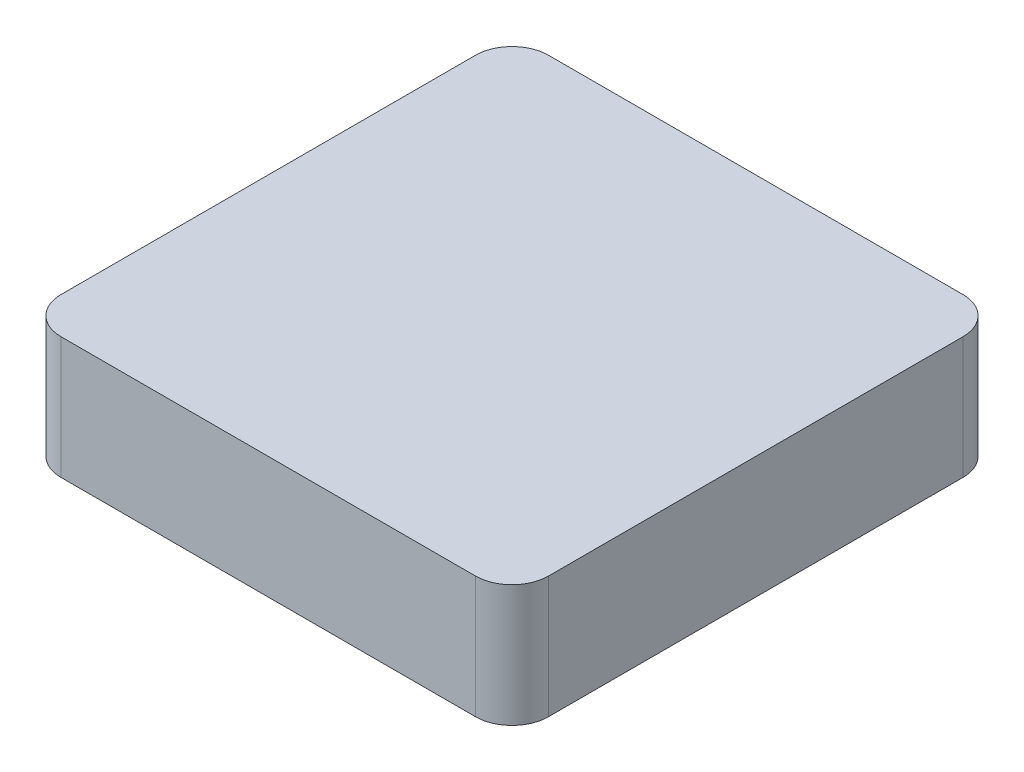
ISO-10303-21;
HEADER;
FILE_DESCRIPTION(('STEP AP214'),'2;1');
FILE_NAME('part.step','',(''),(''),'','','');
FILE_SCHEMA(('AUTOMOTIVE_DESIGN { 1 0 10303 214 1 1 1 1 }'));
ENDSEC;
DATA;
#1=APPLICATION_CONTEXT('core data for automotive mechanical design processes');
#2=APPLICATION_PROTOCOL_DEFINITION('international standard','automotive_design',2000,#1);
#3=PRODUCT_CONTEXT('',#1,'mechanical');
#4=PRODUCT('Part','Part','',(#3));
#5=PRODUCT_RELATED_PRODUCT_CATEGORY('part','',(#4));
#6=PRODUCT_DEFINITION_FORMATION('','',#4);
#7=PRODUCT_DEFINITION_CONTEXT('part definition',#1,'design');
#8=PRODUCT_DEFINITION('design','',#6,#7);
#9=PRODUCT_DEFINITION_SHAPE('','',#8);
#10=(LENGTH_UNIT() NAMED_UNIT(*) SI_UNIT(.MILLI.,.METRE.));
#11=(NAMED_UNIT(*) PLANE_ANGLE_UNIT() SI_UNIT($,.RADIAN.));
#12=(NAMED_UNIT(*) SI_UNIT($,.STERADIAN.) SOLID_ANGLE_UNIT());
#13=UNCERTAINTY_MEASURE_WITH_UNIT(LENGTH_MEASURE(1.E-05),#10,'distance_accuracy_value','');
#14=(GEOMETRIC_REPRESENTATION_CONTEXT(3) GLOBAL_UNCERTAINTY_ASSIGNED_CONTEXT((#13)) GLOBAL_UNIT_ASSIGNED_CONTEXT((#10,
#11,#12)) REPRESENTATION_CONTEXT('',''));
#15=CARTESIAN_POINT('',(0.,0.,0.));
#16=DIRECTION('',(0.,0.,1.));
#17=DIRECTION('',(1.,0.,0.));
#18=AXIS2_PLACEMENT_3D('',#15,#16,#17);
#19=CARTESIAN_POINT('',(-8.5,5.,-8.5));
#20=DIRECTION('',(0.,-1.,0.));
#21=DIRECTION('',(0.,0.,-1.));
#22=AXIS2_PLACEMENT_3D('',#19,#20,#21);
#23=CYLINDRICAL_SURFACE('',#22,1.5);
#24=CARTESIAN_POINT('',(-8.5,0.,-8.5));
#25=DIRECTION('',(0.,1.,0.));
#26=DIRECTION('',(0.,0.,-1.));
#27=AXIS2_PLACEMENT_3D('',#24,#25,#26);
#28=CIRCLE('',#27,1.5);
#29=CARTESIAN_POINT('',(-8.49999999999999,0.,-10.));
#30=VERTEX_POINT('',#29);
#31=CARTESIAN_POINT('',(-10.,0.,-8.49999999999999));
#32=VERTEX_POINT('',#31);
#33=EDGE_CURVE('E140',#30,#32,#28,.T.);
#34=ORIENTED_EDGE('',*,*,#33,.T.);
#35=DIRECTION('',(0.,-1.,0.));
#36=VECTOR('',#35,1.);
#37=CARTESIAN_POINT('',(-10.,5.,-8.49999999999999));
#38=LINE('',#37,#36);
#39=CARTESIAN_POINT('',(-10.,5.,-8.49999999999999));
#40=VERTEX_POINT('',#39);
#41=EDGE_CURVE('E11',#40,#32,#38,.T.);
#42=ORIENTED_EDGE('',*,*,#41,.F.);
#43=CARTESIAN_POINT('',(-8.5,5.,-8.5));
#44=DIRECTION('',(0.,1.,0.));
#45=DIRECTION('',(0.,0.,-1.));
#46=AXIS2_PLACEMENT_3D('',#43,#44,#45);
#47=CIRCLE('',#46,1.5);
#48=CARTESIAN_POINT('',(-8.49999999999999,5.,-10.));
#49=VERTEX_POINT('',#48);
#50=EDGE_CURVE('E162',#49,#40,#47,.T.);
#51=ORIENTED_EDGE('',*,*,#50,.F.);
#52=DIRECTION('',(0.,-1.,0.));
#53=VECTOR('',#52,1.);
#54=CARTESIAN_POINT('',(-8.49999999999999,5.,-10.));
#55=LINE('',#54,#53);
#56=EDGE_CURVE('E136',#49,#30,#55,.T.);
#57=ORIENTED_EDGE('',*,*,#56,.T.);
#58=EDGE_LOOP('',(#34,#42,#51,#57));
#59=FACE_BOUND('',#58,.T.);
#60=ADVANCED_FACE('F39',(#59),#23,.T.);
#61=CARTESIAN_POINT('',(-10.,5.,8.49999999999999));
#62=DIRECTION('',(1.,0.,0.));
#63=DIRECTION('',(0.,0.,-1.));
#64=AXIS2_PLACEMENT_3D('',#61,#62,#63);
#65=PLANE('',#64);
#66=DIRECTION('',(0.,0.,1.));
#67=VECTOR('',#66,1.);
#68=CARTESIAN_POINT('',(-10.,0.,8.49999999999999));
#69=LINE('',#68,#67);
#70=CARTESIAN_POINT('',(-10.,0.,8.49999999999999));
#71=VERTEX_POINT('',#70);
#72=EDGE_CURVE('E144',#32,#71,#69,.T.);
#73=ORIENTED_EDGE('',*,*,#72,.T.);
#74=DIRECTION('',(0.,-1.,0.));
#75=VECTOR('',#74,1.);
#76=CARTESIAN_POINT('',(-10.,5.,8.49999999999999));
#77=LINE('',#76,#75);
#78=CARTESIAN_POINT('',(-10.,5.,8.49999999999999));
#79=VERTEX_POINT('',#78);
#80=EDGE_CURVE('E48',#79,#71,#77,.T.);
#81=ORIENTED_EDGE('',*,*,#80,.F.);
#82=DIRECTION('',(0.,0.,1.));
#83=VECTOR('',#82,1.);
#84=CARTESIAN_POINT('',(-10.,5.,8.49999999999999));
#85=LINE('',#84,#83);
#86=EDGE_CURVE('E99',#40,#79,#85,.T.);
#87=ORIENTED_EDGE('',*,*,#86,.F.);
#88=ORIENTED_EDGE('',*,*,#41,.T.);
#89=EDGE_LOOP('',(#73,#81,#87,#88));
#90=FACE_BOUND('',#89,.T.);
#91=ADVANCED_FACE('F208',(#90),#65,.F.);
#92=CARTESIAN_POINT('',(-8.5,5.,8.5));
#93=DIRECTION('',(0.,-1.,0.));
#94=DIRECTION('',(0.,0.,-1.));
#95=AXIS2_PLACEMENT_3D('',#92,#93,#94);
#96=CYLINDRICAL_SURFACE('',#95,1.5);
#97=CARTESIAN_POINT('',(-8.5,0.,8.5));
#98=DIRECTION('',(0.,1.,0.));
#99=DIRECTION('',(0.,0.,-1.));
#100=AXIS2_PLACEMENT_3D('',#97,#98,#99);
#101=CIRCLE('',#100,1.5);
#102=CARTESIAN_POINT('',(-8.49999999999999,0.,10.));
#103=VERTEX_POINT('',#102);
#104=EDGE_CURVE('E147',#71,#103,#101,.T.);
#105=ORIENTED_EDGE('',*,*,#104,.T.);
#106=DIRECTION('',(0.,-1.,0.));
#107=VECTOR('',#106,1.);
#108=CARTESIAN_POINT('',(-8.49999999999999,5.,10.));
#109=LINE('',#108,#107);
#110=CARTESIAN_POINT('',(-8.49999999999999,5.,10.));
#111=VERTEX_POINT('',#110);
#112=EDGE_CURVE('E173',#111,#103,#109,.T.);
#113=ORIENTED_EDGE('',*,*,#112,.F.);
#114=CARTESIAN_POINT('',(-8.5,5.,8.5));
#115=DIRECTION('',(0.,1.,0.));
#116=DIRECTION('',(0.,0.,-1.));
#117=AXIS2_PLACEMENT_3D('',#114,#115,#116);
#118=CIRCLE('',#117,1.5);
#119=EDGE_CURVE('E183',#79,#111,#118,.T.);
#120=ORIENTED_EDGE('',*,*,#119,.F.);
#121=ORIENTED_EDGE('',*,*,#80,.T.);
#122=EDGE_LOOP('',(#105,#113,#120,#121));
#123=FACE_BOUND('',#122,.T.);
#124=ADVANCED_FACE('F181',(#123),#96,.T.);
#125=CARTESIAN_POINT('',(-8.49999999999999,5.,10.));
#126=DIRECTION('',(0.,0.,-1.));
#127=DIRECTION('',(-1.,0.,0.));
#128=AXIS2_PLACEMENT_3D('',#125,#126,#127);
#129=PLANE('',#128);
#130=DIRECTION('',(1.,0.,0.));
#131=VECTOR('',#130,1.);
#132=CARTESIAN_POINT('',(-8.49999999999999,0.,10.));
#133=LINE('',#132,#131);
#134=CARTESIAN_POINT('',(8.49999999999999,0.,10.));
#135=VERTEX_POINT('',#134);
#136=EDGE_CURVE('E150',#103,#135,#133,.T.);
#137=ORIENTED_EDGE('',*,*,#136,.T.);
#138=DIRECTION('',(0.,-1.,0.));
#139=VECTOR('',#138,1.);
#140=CARTESIAN_POINT('',(8.49999999999999,5.,10.));
#141=LINE('',#140,#139);
#142=CARTESIAN_POINT('',(8.49999999999999,5.,10.));
#143=VERTEX_POINT('',#142);
#144=EDGE_CURVE('E169',#143,#135,#141,.T.);
#145=ORIENTED_EDGE('',*,*,#144,.F.);
#146=DIRECTION('',(1.,0.,0.));
#147=VECTOR('',#146,1.);
#148=CARTESIAN_POINT('',(-8.49999999999999,5.,10.));
#149=LINE('',#148,#147);
#150=EDGE_CURVE('E196',#111,#143,#149,.T.);
#151=ORIENTED_EDGE('',*,*,#150,.F.);
#152=ORIENTED_EDGE('',*,*,#112,.T.);
#153=EDGE_LOOP('',(#137,#145,#151,#152));
#154=FACE_BOUND('',#153,.T.);
#155=ADVANCED_FACE('F191',(#154),#129,.F.);
#156=CARTESIAN_POINT('',(8.5,5.,8.5));
#157=DIRECTION('',(0.,-1.,0.));
#158=DIRECTION('',(0.,0.,-1.));
#159=AXIS2_PLACEMENT_3D('',#156,#157,#158);
#160=CYLINDRICAL_SURFACE('',#159,1.5);
#161=CARTESIAN_POINT('',(8.5,0.,8.5));
#162=DIRECTION('',(0.,1.,0.));
#163=DIRECTION('',(0.,0.,1.));
#164=AXIS2_PLACEMENT_3D('',#161,#162,#163);
#165=CIRCLE('',#164,1.5);
#166=CARTESIAN_POINT('',(10.,0.,8.49999999999999));
#167=VERTEX_POINT('',#166);
#168=EDGE_CURVE('E153',#135,#167,#165,.T.);
#169=ORIENTED_EDGE('',*,*,#168,.T.);
#170=DIRECTION('',(0.,-1.,0.));
#171=VECTOR('',#170,1.);
#172=CARTESIAN_POINT('',(10.,5.,8.49999999999999));
#173=LINE('',#172,#171);
#174=CARTESIAN_POINT('',(10.,5.,8.49999999999999));
#175=VERTEX_POINT('',#174);
#176=EDGE_CURVE('E129',#175,#167,#173,.T.);
#177=ORIENTED_EDGE('',*,*,#176,.F.);
#178=CARTESIAN_POINT('',(8.5,5.,8.5));
#179=DIRECTION('',(0.,1.,0.));
#180=DIRECTION('',(0.,0.,1.));
#181=AXIS2_PLACEMENT_3D('',#178,#179,#180);
#182=CIRCLE('',#181,1.5);
#183=EDGE_CURVE('E118',#143,#175,#182,.T.);
#184=ORIENTED_EDGE('',*,*,#183,.F.);
#185=ORIENTED_EDGE('',*,*,#144,.T.);
#186=EDGE_LOOP('',(#169,#177,#184,#185));
#187=FACE_BOUND('',#186,.T.);
#188=ADVANCED_FACE('F194',(#187),#160,.T.);
#189=CARTESIAN_POINT('',(10.,5.,8.49999999999999));
#190=DIRECTION('',(-1.,0.,0.));
#191=DIRECTION('',(0.,0.,1.));
#192=AXIS2_PLACEMENT_3D('',#189,#190,#191);
#193=PLANE('',#192);
#194=DIRECTION('',(0.,0.,-1.));
#195=VECTOR('',#194,1.);
#196=CARTESIAN_POINT('',(10.,0.,8.49999999999999));
#197=LINE('',#196,#195);
#198=CARTESIAN_POINT('',(10.,0.,-8.49999999999999));
#199=VERTEX_POINT('',#198);
#200=EDGE_CURVE('E127',#167,#199,#197,.T.);
#201=ORIENTED_EDGE('',*,*,#200,.T.);
#202=DIRECTION('',(0.,-1.,0.));
#203=VECTOR('',#202,1.);
#204=CARTESIAN_POINT('',(10.,5.,-8.49999999999999));
#205=LINE('',#204,#203);
#206=CARTESIAN_POINT('',(10.,5.,-8.49999999999999));
#207=VERTEX_POINT('',#206);
#208=EDGE_CURVE('E124',#207,#199,#205,.T.);
#209=ORIENTED_EDGE('',*,*,#208,.F.);
#210=DIRECTION('',(0.,0.,-1.));
#211=VECTOR('',#210,1.);
#212=CARTESIAN_POINT('',(10.,5.,8.49999999999999));
#213=LINE('',#212,#211);
#214=EDGE_CURVE('E112',#175,#207,#213,.T.);
#215=ORIENTED_EDGE('',*,*,#214,.F.);
#216=ORIENTED_EDGE('',*,*,#176,.T.);
#217=EDGE_LOOP('',(#201,#209,#215,#216));
#218=FACE_BOUND('',#217,.T.);
#219=ADVANCED_FACE('F125',(#218),#193,.F.);
#220=CARTESIAN_POINT('',(8.5,5.,-8.5));
#221=DIRECTION('',(0.,-1.,0.));
#222=DIRECTION('',(0.,0.,-1.));
#223=AXIS2_PLACEMENT_3D('',#220,#221,#222);
#224=CYLINDRICAL_SURFACE('',#223,1.5);
#225=CARTESIAN_POINT('',(8.5,0.,-8.5));
#226=DIRECTION('',(0.,1.,0.));
#227=DIRECTION('',(0.,0.,-1.));
#228=AXIS2_PLACEMENT_3D('',#225,#226,#227);
#229=CIRCLE('',#228,1.5);
#230=CARTESIAN_POINT('',(8.49999999999999,0.,-10.));
#231=VERTEX_POINT('',#230);
#232=EDGE_CURVE('E85',#199,#231,#229,.T.);
#233=ORIENTED_EDGE('',*,*,#232,.T.);
#234=DIRECTION('',(0.,-1.,0.));
#235=VECTOR('',#234,1.);
#236=CARTESIAN_POINT('',(8.49999999999999,5.,-10.));
#237=LINE('',#236,#235);
#238=CARTESIAN_POINT('',(8.49999999999999,5.,-10.));
#239=VERTEX_POINT('',#238);
#240=EDGE_CURVE('E130',#239,#231,#237,.T.);
#241=ORIENTED_EDGE('',*,*,#240,.F.);
#242=CARTESIAN_POINT('',(8.5,5.,-8.5));
#243=DIRECTION('',(0.,1.,0.));
#244=DIRECTION('',(0.,0.,-1.));
#245=AXIS2_PLACEMENT_3D('',#242,#243,#244);
#246=CIRCLE('',#245,1.5);
#247=EDGE_CURVE('E116',#207,#239,#246,.T.);
#248=ORIENTED_EDGE('',*,*,#247,.F.);
#249=ORIENTED_EDGE('',*,*,#208,.T.);
#250=EDGE_LOOP('',(#233,#241,#248,#249));
#251=FACE_BOUND('',#250,.T.);
#252=ADVANCED_FACE('F132',(#251),#224,.T.);
#253=CARTESIAN_POINT('',(-8.49999999999999,5.,-10.));
#254=DIRECTION('',(0.,0.,1.));
#255=DIRECTION('',(1.,0.,0.));
#256=AXIS2_PLACEMENT_3D('',#253,#254,#255);
#257=PLANE('',#256);
#258=DIRECTION('',(-1.,0.,0.));
#259=VECTOR('',#258,1.);
#260=CARTESIAN_POINT('',(-8.49999999999999,0.,-10.));
#261=LINE('',#260,#259);
#262=EDGE_CURVE('E91',#231,#30,#261,.T.);
#263=ORIENTED_EDGE('',*,*,#262,.T.);
#264=ORIENTED_EDGE('',*,*,#56,.F.);
#265=DIRECTION('',(-1.,0.,0.));
#266=VECTOR('',#265,1.);
#267=CARTESIAN_POINT('',(-8.49999999999999,5.,-10.));
#268=LINE('',#267,#266);
#269=EDGE_CURVE('E56',#239,#49,#268,.T.);
#270=ORIENTED_EDGE('',*,*,#269,.F.);
#271=ORIENTED_EDGE('',*,*,#240,.T.);
#272=EDGE_LOOP('',(#263,#264,#270,#271));
#273=FACE_BOUND('',#272,.T.);
#274=ADVANCED_FACE('F224',(#273),#257,.F.);
#275=CARTESIAN_POINT('',(-8.5,5.,-8.5));
#276=DIRECTION('',(0.,-1.,0.));
#277=DIRECTION('',(0.,0.,-1.));
#278=AXIS2_PLACEMENT_3D('',#275,#276,#277);
#279=PLANE('',#278);
#280=ORIENTED_EDGE('',*,*,#50,.T.);
#281=ORIENTED_EDGE('',*,*,#86,.T.);
#282=ORIENTED_EDGE('',*,*,#119,.T.);
#283=ORIENTED_EDGE('',*,*,#150,.T.);
#284=ORIENTED_EDGE('',*,*,#183,.T.);
#285=ORIENTED_EDGE('',*,*,#214,.T.);
#286=ORIENTED_EDGE('',*,*,#247,.T.);
#287=ORIENTED_EDGE('',*,*,#269,.T.);
#288=EDGE_LOOP('',(#280,#281,#282,#283,#284,#285,#286,#287));
#289=FACE_BOUND('',#288,.T.);
#290=ADVANCED_FACE('F114',(#289),#279,.F.);
#291=CARTESIAN_POINT('',(-8.5,0.,-8.5));
#292=DIRECTION('',(0.,-1.,0.));
#293=DIRECTION('',(0.,0.,-1.));
#294=AXIS2_PLACEMENT_3D('',#291,#292,#293);
#295=PLANE('',#294);
#296=ORIENTED_EDGE('',*,*,#33,.F.);
#297=ORIENTED_EDGE('',*,*,#262,.F.);
#298=ORIENTED_EDGE('',*,*,#232,.F.);
#299=ORIENTED_EDGE('',*,*,#200,.F.);
#300=ORIENTED_EDGE('',*,*,#168,.F.);
#301=ORIENTED_EDGE('',*,*,#136,.F.);
#302=ORIENTED_EDGE('',*,*,#104,.F.);
#303=ORIENTED_EDGE('',*,*,#72,.F.);
#304=EDGE_LOOP('',(#296,#297,#298,#299,#300,#301,#302,#303));
#305=FACE_BOUND('',#304,.T.);
#306=ADVANCED_FACE('F187',(#305),#295,.T.);
#307=CLOSED_SHELL('',(#60,#91,#124,#155,#188,#219,#252,#274,#290,#306));
#308=MANIFOLD_SOLID_BREP('B2',#307);
#309=ADVANCED_BREP_SHAPE_REPRESENTATION('',(#18,#308),#14);
#310=SHAPE_DEFINITION_REPRESENTATION(#9,#309);
ENDSEC;
END-ISO-10303-21;
